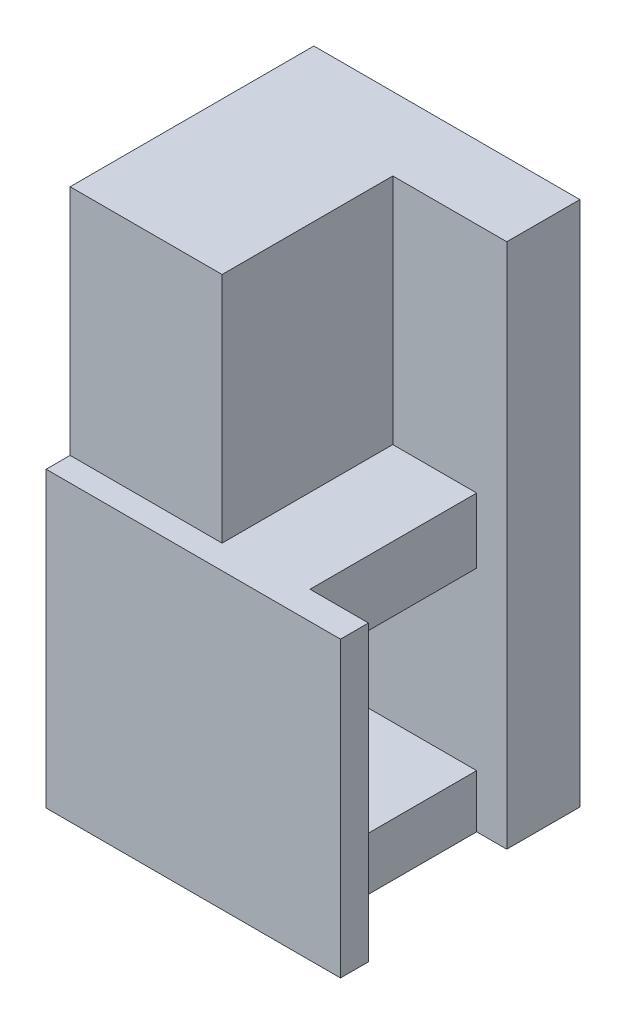
ISO-10303-21;
HEADER;
FILE_DESCRIPTION(('STEP AP214'),'2;1');
FILE_NAME('part.step','',(''),(''),'','','');
FILE_SCHEMA(('AUTOMOTIVE_DESIGN { 1 0 10303 214 1 1 1 1 }'));
ENDSEC;
DATA;
#1=APPLICATION_CONTEXT('core data for automotive mechanical design processes');
#2=APPLICATION_PROTOCOL_DEFINITION('international standard','automotive_design',2000,#1);
#3=PRODUCT_CONTEXT('',#1,'mechanical');
#4=PRODUCT('Part','Part','',(#3));
#5=PRODUCT_RELATED_PRODUCT_CATEGORY('part','',(#4));
#6=PRODUCT_DEFINITION_FORMATION('','',#4);
#7=PRODUCT_DEFINITION_CONTEXT('part definition',#1,'design');
#8=PRODUCT_DEFINITION('design','',#6,#7);
#9=PRODUCT_DEFINITION_SHAPE('','',#8);
#10=(LENGTH_UNIT() NAMED_UNIT(*) SI_UNIT(.MILLI.,.METRE.));
#11=(NAMED_UNIT(*) PLANE_ANGLE_UNIT() SI_UNIT($,.RADIAN.));
#12=(NAMED_UNIT(*) SI_UNIT($,.STERADIAN.) SOLID_ANGLE_UNIT());
#13=UNCERTAINTY_MEASURE_WITH_UNIT(LENGTH_MEASURE(1.E-05),#10,'distance_accuracy_value','');
#14=(GEOMETRIC_REPRESENTATION_CONTEXT(3) GLOBAL_UNCERTAINTY_ASSIGNED_CONTEXT((#13)) GLOBAL_UNIT_ASSIGNED_CONTEXT((#10,
#11,#12)) REPRESENTATION_CONTEXT('',''));
#15=CARTESIAN_POINT('',(0.,0.,0.));
#16=DIRECTION('',(0.,0.,1.));
#17=DIRECTION('',(1.,0.,0.));
#18=AXIS2_PLACEMENT_3D('',#15,#16,#17);
#19=CARTESIAN_POINT('',(502.75,344.704178151443,428.057475320664));
#20=DIRECTION('',(0.,0.,1.));
#21=DIRECTION('',(-1.,0.,0.));
#22=AXIS2_PLACEMENT_3D('',#19,#20,#21);
#23=PLANE('',#22);
#24=DIRECTION('',(0.,1.,0.));
#25=VECTOR('',#24,1.);
#26=CARTESIAN_POINT('',(525.5,299.704178151443,428.057475320664));
#27=LINE('',#26,#25);
#28=CARTESIAN_POINT('',(525.5,299.704178151443,428.057475320664));
#29=VERTEX_POINT('',#28);
#30=CARTESIAN_POINT('',(525.5,389.704178151443,428.057475320664));
#31=VERTEX_POINT('',#30);
#32=EDGE_CURVE('E11',#29,#31,#27,.T.);
#33=ORIENTED_EDGE('',*,*,#32,.F.);
#34=DIRECTION('',(1.,0.,0.));
#35=VECTOR('',#34,1.);
#36=CARTESIAN_POINT('',(480.,299.704178151443,428.057475320664));
#37=LINE('',#36,#35);
#38=CARTESIAN_POINT('',(480.,299.704178151443,428.057475320664));
#39=VERTEX_POINT('',#38);
#40=EDGE_CURVE('E24',#39,#29,#37,.T.);
#41=ORIENTED_EDGE('',*,*,#40,.F.);
#42=DIRECTION('',(0.,-1.,0.));
#43=VECTOR('',#42,1.);
#44=CARTESIAN_POINT('',(480.,389.704178151443,428.057475320664));
#45=LINE('',#44,#43);
#46=CARTESIAN_POINT('',(480.,389.704178151443,428.057475320664));
#47=VERTEX_POINT('',#46);
#48=EDGE_CURVE('E417',#47,#39,#45,.T.);
#49=ORIENTED_EDGE('',*,*,#48,.F.);
#50=DIRECTION('',(-1.,0.,0.));
#51=VECTOR('',#50,1.);
#52=CARTESIAN_POINT('',(525.5,389.704178151443,428.057475320664));
#53=LINE('',#52,#51);
#54=EDGE_CURVE('E412',#31,#47,#53,.T.);
#55=ORIENTED_EDGE('',*,*,#54,.F.);
#56=EDGE_LOOP('',(#33,#41,#49,#55));
#57=FACE_BOUND('',#56,.T.);
#58=ADVANCED_FACE('F16',(#57),#23,.F.);
#59=CARTESIAN_POINT('',(525.5,299.704178151443,428.057475320664));
#60=DIRECTION('',(1.,0.,0.));
#61=DIRECTION('',(0.,1.,0.));
#62=AXIS2_PLACEMENT_3D('',#59,#60,#61);
#63=PLANE('',#62);
#64=ORIENTED_EDGE('',*,*,#32,.T.);
#65=DIRECTION('',(0.,0.,1.));
#66=VECTOR('',#65,1.);
#67=CARTESIAN_POINT('',(525.5,389.704178151443,428.057475320664));
#68=LINE('',#67,#66);
#69=CARTESIAN_POINT('',(525.5,389.704178151443,440.557475320664));
#70=VERTEX_POINT('',#69);
#71=EDGE_CURVE('E408',#31,#70,#68,.T.);
#72=ORIENTED_EDGE('',*,*,#71,.T.);
#73=DIRECTION('',(0.,1.,0.));
#74=VECTOR('',#73,1.);
#75=CARTESIAN_POINT('',(525.5,299.704178151443,440.557475320664));
#76=LINE('',#75,#74);
#77=CARTESIAN_POINT('',(525.5,299.704178151443,440.557475320664));
#78=VERTEX_POINT('',#77);
#79=EDGE_CURVE('E403',#78,#70,#76,.T.);
#80=ORIENTED_EDGE('',*,*,#79,.F.);
#81=DIRECTION('',(0.,0.,1.));
#82=VECTOR('',#81,1.);
#83=CARTESIAN_POINT('',(525.5,299.704178151443,428.057475320664));
#84=LINE('',#83,#82);
#85=EDGE_CURVE('E398',#29,#78,#84,.T.);
#86=ORIENTED_EDGE('',*,*,#85,.F.);
#87=EDGE_LOOP('',(#64,#72,#80,#86));
#88=FACE_BOUND('',#87,.T.);
#89=ADVANCED_FACE('F435',(#88),#63,.T.);
#90=CARTESIAN_POINT('',(480.,389.704178151443,428.057475320664));
#91=DIRECTION('',(-1.,0.,0.));
#92=DIRECTION('',(0.,-1.,0.));
#93=AXIS2_PLACEMENT_3D('',#90,#91,#92);
#94=PLANE('',#93);
#95=DIRECTION('',(0.,-1.,0.));
#96=VECTOR('',#95,1.);
#97=CARTESIAN_POINT('',(480.,349.240469703761,460.057475320664));
#98=LINE('',#97,#96);
#99=CARTESIAN_POINT('',(480.,338.776761256078,460.057475320664));
#100=VERTEX_POINT('',#99);
#101=CARTESIAN_POINT('',(480.,308.776761256078,460.057475320664));
#102=VERTEX_POINT('',#101);
#103=EDGE_CURVE('E394',#100,#102,#98,.T.);
#104=ORIENTED_EDGE('',*,*,#103,.T.);
#105=DIRECTION('',(0.,0.,-1.));
#106=VECTOR('',#105,1.);
#107=CARTESIAN_POINT('',(480.,308.776761256079,434.307475320664));
#108=LINE('',#107,#106);
#109=CARTESIAN_POINT('',(480.,308.776761256078,440.557475320664));
#110=VERTEX_POINT('',#109);
#111=EDGE_CURVE('E390',#102,#110,#108,.T.);
#112=ORIENTED_EDGE('',*,*,#111,.T.);
#113=DIRECTION('',(0.,1.,0.));
#114=VECTOR('',#113,1.);
#115=CARTESIAN_POINT('',(480.,364.240469703761,440.557475320664));
#116=LINE('',#115,#114);
#117=CARTESIAN_POINT('',(480.,338.776761256078,440.557475320664));
#118=VERTEX_POINT('',#117);
#119=EDGE_CURVE('E386',#110,#118,#116,.T.);
#120=ORIENTED_EDGE('',*,*,#119,.T.);
#121=DIRECTION('',(0.,0.,1.));
#122=VECTOR('',#121,1.);
#123=CARTESIAN_POINT('',(480.,338.776761256078,444.057475320664));
#124=LINE('',#123,#122);
#125=EDGE_CURVE('E382',#118,#100,#124,.T.);
#126=ORIENTED_EDGE('',*,*,#125,.T.);
#127=EDGE_LOOP('',(#104,#112,#120,#126));
#128=FACE_BOUND('',#127,.T.);
#129=DIRECTION('',(0.,1.,0.));
#130=VECTOR('',#129,1.);
#131=CARTESIAN_POINT('',(480.,357.254178151443,473.857475320664));
#132=LINE('',#131,#130);
#133=CARTESIAN_POINT('',(480.,299.704178151443,473.857475320664));
#134=VERTEX_POINT('',#133);
#135=CARTESIAN_POINT('',(480.,349.904178151443,473.857475320664));
#136=VERTEX_POINT('',#135);
#137=EDGE_CURVE('E378',#134,#136,#132,.T.);
#138=ORIENTED_EDGE('',*,*,#137,.T.);
#139=DIRECTION('',(0.,0.,-1.));
#140=VECTOR('',#139,1.);
#141=CARTESIAN_POINT('',(480.,349.904178151443,455.407475320664));
#142=LINE('',#141,#140);
#143=CARTESIAN_POINT('',(480.,349.904178151443,469.757475320664));
#144=VERTEX_POINT('',#143);
#145=EDGE_CURVE('E167',#136,#144,#142,.T.);
#146=ORIENTED_EDGE('',*,*,#145,.T.);
#147=DIRECTION('',(0.,1.,0.));
#148=VECTOR('',#147,1.);
#149=CARTESIAN_POINT('',(480.,367.204178151443,469.757475320664));
#150=LINE('',#149,#148);
#151=CARTESIAN_POINT('',(480.,389.704178151443,469.757475320664));
#152=VERTEX_POINT('',#151);
#153=EDGE_CURVE('E371',#144,#152,#150,.T.);
#154=ORIENTED_EDGE('',*,*,#153,.T.);
#155=DIRECTION('',(0.,0.,1.));
#156=VECTOR('',#155,1.);
#157=CARTESIAN_POINT('',(480.,389.704178151443,428.057475320664));
#158=LINE('',#157,#156);
#159=EDGE_CURVE('E366',#47,#152,#158,.T.);
#160=ORIENTED_EDGE('',*,*,#159,.F.);
#161=ORIENTED_EDGE('',*,*,#48,.T.);
#162=DIRECTION('',(0.,0.,1.));
#163=VECTOR('',#162,1.);
#164=CARTESIAN_POINT('',(480.,299.704178151443,428.057475320664));
#165=LINE('',#164,#163);
#166=EDGE_CURVE('E362',#39,#134,#165,.T.);
#167=ORIENTED_EDGE('',*,*,#166,.T.);
#168=EDGE_LOOP('',(#138,#146,#154,#160,#161,#167));
#169=FACE_BOUND('',#168,.T.);
#170=ADVANCED_FACE('F430',(#128,#169),#94,.T.);
#171=CARTESIAN_POINT('',(502.75,344.704178151443,440.557475320664));
#172=DIRECTION('',(0.,0.,1.));
#173=DIRECTION('',(0.,1.,0.));
#174=AXIS2_PLACEMENT_3D('',#171,#172,#173);
#175=PLANE('',#174);
#176=DIRECTION('',(0.,-1.,0.));
#177=VECTOR('',#176,1.);
#178=CARTESIAN_POINT('',(520.35,347.304178151443,440.557475320664));
#179=LINE('',#178,#177);
#180=CARTESIAN_POINT('',(520.35,349.904178151443,440.557475320664));
#181=VERTEX_POINT('',#180);
#182=CARTESIAN_POINT('',(520.35,338.776761256078,440.557475320664));
#183=VERTEX_POINT('',#182);
#184=EDGE_CURVE('E358',#181,#183,#179,.T.);
#185=ORIENTED_EDGE('',*,*,#184,.T.);
#186=DIRECTION('',(-1.,0.,0.));
#187=VECTOR('',#186,1.);
#188=CARTESIAN_POINT('',(520.35,338.776761256078,440.557475320664));
#189=LINE('',#188,#187);
#190=EDGE_CURVE('E353',#183,#118,#189,.T.);
#191=ORIENTED_EDGE('',*,*,#190,.T.);
#192=ORIENTED_EDGE('',*,*,#119,.F.);
#193=DIRECTION('',(-1.,0.,0.));
#194=VECTOR('',#193,1.);
#195=CARTESIAN_POINT('',(520.35,308.776761256078,440.557475320664));
#196=LINE('',#195,#194);
#197=CARTESIAN_POINT('',(520.35,308.776761256078,440.557475320664));
#198=VERTEX_POINT('',#197);
#199=EDGE_CURVE('E348',#198,#110,#196,.T.);
#200=ORIENTED_EDGE('',*,*,#199,.F.);
#201=DIRECTION('',(0.,-1.,0.));
#202=VECTOR('',#201,1.);
#203=CARTESIAN_POINT('',(520.35,347.304178151443,440.557475320664));
#204=LINE('',#203,#202);
#205=CARTESIAN_POINT('',(520.35,299.704178151443,440.557475320664));
#206=VERTEX_POINT('',#205);
#207=EDGE_CURVE('E344',#198,#206,#204,.T.);
#208=ORIENTED_EDGE('',*,*,#207,.T.);
#209=DIRECTION('',(1.,0.,0.));
#210=VECTOR('',#209,1.);
#211=CARTESIAN_POINT('',(480.,299.704178151443,440.557475320664));
#212=LINE('',#211,#210);
#213=EDGE_CURVE('E339',#206,#78,#212,.T.);
#214=ORIENTED_EDGE('',*,*,#213,.T.);
#215=ORIENTED_EDGE('',*,*,#79,.T.);
#216=DIRECTION('',(-1.,0.,0.));
#217=VECTOR('',#216,1.);
#218=CARTESIAN_POINT('',(525.5,389.704178151443,440.557475320664));
#219=LINE('',#218,#217);
#220=CARTESIAN_POINT('',(506.,389.704178151443,440.557475320664));
#221=VERTEX_POINT('',#220);
#222=EDGE_CURVE('E335',#70,#221,#219,.T.);
#223=ORIENTED_EDGE('',*,*,#222,.T.);
#224=DIRECTION('',(0.,-1.,0.));
#225=VECTOR('',#224,1.);
#226=CARTESIAN_POINT('',(506.,322.204178151443,440.557475320664));
#227=LINE('',#226,#225);
#228=CARTESIAN_POINT('',(506.,349.904178151443,440.557475320664));
#229=VERTEX_POINT('',#228);
#230=EDGE_CURVE('E331',#221,#229,#227,.T.);
#231=ORIENTED_EDGE('',*,*,#230,.T.);
#232=DIRECTION('',(1.,0.,0.));
#233=VECTOR('',#232,1.);
#234=CARTESIAN_POINT('',(504.375,349.904178151443,440.557475320664));
#235=LINE('',#234,#233);
#236=EDGE_CURVE('E327',#229,#181,#235,.T.);
#237=ORIENTED_EDGE('',*,*,#236,.T.);
#238=EDGE_LOOP('',(#185,#191,#192,#200,#208,#214,#215,#223,#231,#237));
#239=FACE_BOUND('',#238,.T.);
#240=ADVANCED_FACE('F441',(#239),#175,.T.);
#241=CARTESIAN_POINT('',(506.,299.704178151443,440.557475320664));
#242=DIRECTION('',(1.,0.,0.));
#243=DIRECTION('',(0.,1.,0.));
#244=AXIS2_PLACEMENT_3D('',#241,#242,#243);
#245=PLANE('',#244);
#246=DIRECTION('',(0.,-1.,0.));
#247=VECTOR('',#246,1.);
#248=CARTESIAN_POINT('',(506.,322.204178151443,469.757475320664));
#249=LINE('',#248,#247);
#250=CARTESIAN_POINT('',(506.,389.704178151443,469.757475320664));
#251=VERTEX_POINT('',#250);
#252=CARTESIAN_POINT('',(506.,349.904178151443,469.757475320664));
#253=VERTEX_POINT('',#252);
#254=EDGE_CURVE('E323',#251,#253,#249,.T.);
#255=ORIENTED_EDGE('',*,*,#254,.T.);
#256=DIRECTION('',(0.,0.,-1.));
#257=VECTOR('',#256,1.);
#258=CARTESIAN_POINT('',(506.,349.904178151443,461.657475320664));
#259=LINE('',#258,#257);
#260=EDGE_CURVE('E318',#253,#229,#259,.T.);
#261=ORIENTED_EDGE('',*,*,#260,.T.);
#262=ORIENTED_EDGE('',*,*,#230,.F.);
#263=DIRECTION('',(0.,0.,1.));
#264=VECTOR('',#263,1.);
#265=CARTESIAN_POINT('',(506.,389.704178151443,440.557475320664));
#266=LINE('',#265,#264);
#267=EDGE_CURVE('E314',#221,#251,#266,.T.);
#268=ORIENTED_EDGE('',*,*,#267,.T.);
#269=EDGE_LOOP('',(#255,#261,#262,#268));
#270=FACE_BOUND('',#269,.T.);
#271=ADVANCED_FACE('F443',(#270),#245,.T.);
#272=CARTESIAN_POINT('',(480.,299.704178151443,428.057475320664));
#273=DIRECTION('',(0.,-1.,0.));
#274=DIRECTION('',(1.,0.,0.));
#275=AXIS2_PLACEMENT_3D('',#272,#273,#274);
#276=PLANE('',#275);
#277=DIRECTION('',(-1.,0.,0.));
#278=VECTOR('',#277,1.);
#279=CARTESIAN_POINT('',(490.0875,299.704178151443,473.857475320664));
#280=LINE('',#279,#278);
#281=CARTESIAN_POINT('',(530.35,299.704178151443,473.857475320664));
#282=VERTEX_POINT('',#281);
#283=EDGE_CURVE('E173',#282,#134,#280,.T.);
#284=ORIENTED_EDGE('',*,*,#283,.T.);
#285=ORIENTED_EDGE('',*,*,#166,.F.);
#286=ORIENTED_EDGE('',*,*,#40,.T.);
#287=ORIENTED_EDGE('',*,*,#85,.T.);
#288=ORIENTED_EDGE('',*,*,#213,.F.);
#289=DIRECTION('',(0.,0.,1.));
#290=VECTOR('',#289,1.);
#291=CARTESIAN_POINT('',(520.35,299.704178151443,482.757475320664));
#292=LINE('',#291,#290);
#293=CARTESIAN_POINT('',(520.35,299.704178151443,469.068178567133));
#294=VERTEX_POINT('',#293);
#295=EDGE_CURVE('E307',#206,#294,#292,.T.);
#296=ORIENTED_EDGE('',*,*,#295,.T.);
#297=DIRECTION('',(-1.,0.,0.));
#298=VECTOR('',#297,1.);
#299=CARTESIAN_POINT('',(520.35,299.704178151443,469.068178567133));
#300=LINE('',#299,#298);
#301=CARTESIAN_POINT('',(530.35,299.704178151443,469.068178567133));
#302=VERTEX_POINT('',#301);
#303=EDGE_CURVE('E302',#302,#294,#300,.T.);
#304=ORIENTED_EDGE('',*,*,#303,.F.);
#305=DIRECTION('',(0.,0.,-1.));
#306=VECTOR('',#305,1.);
#307=CARTESIAN_POINT('',(530.35,299.704178151443,486.857475320664));
#308=LINE('',#307,#306);
#309=EDGE_CURVE('E298',#282,#302,#308,.T.);
#310=ORIENTED_EDGE('',*,*,#309,.F.);
#311=EDGE_LOOP('',(#284,#285,#286,#287,#288,#296,#304,#310));
#312=FACE_BOUND('',#311,.T.);
#313=ADVANCED_FACE('F427',(#312),#276,.T.);
#314=CARTESIAN_POINT('',(520.35,308.776761256078,440.557475320664));
#315=DIRECTION('',(0.,-1.,0.));
#316=DIRECTION('',(0.,0.,1.));
#317=AXIS2_PLACEMENT_3D('',#314,#315,#316);
#318=PLANE('',#317);
#319=ORIENTED_EDGE('',*,*,#111,.F.);
#320=DIRECTION('',(-1.,0.,0.));
#321=VECTOR('',#320,1.);
#322=CARTESIAN_POINT('',(520.35,308.776761256078,460.057475320664));
#323=LINE('',#322,#321);
#324=CARTESIAN_POINT('',(520.35,308.776761256078,460.057475320664));
#325=VERTEX_POINT('',#324);
#326=EDGE_CURVE('E293',#325,#102,#323,.T.);
#327=ORIENTED_EDGE('',*,*,#326,.F.);
#328=DIRECTION('',(0.,0.,1.));
#329=VECTOR('',#328,1.);
#330=CARTESIAN_POINT('',(520.35,308.776761256078,461.657475320664));
#331=LINE('',#330,#329);
#332=EDGE_CURVE('E288',#198,#325,#331,.T.);
#333=ORIENTED_EDGE('',*,*,#332,.F.);
#334=ORIENTED_EDGE('',*,*,#199,.T.);
#335=EDGE_LOOP('',(#319,#327,#333,#334));
#336=FACE_BOUND('',#335,.T.);
#337=ADVANCED_FACE('F465',(#336),#318,.F.);
#338=CARTESIAN_POINT('',(520.35,308.776761256078,460.057475320664));
#339=DIRECTION('',(0.,0.,1.));
#340=DIRECTION('',(0.,1.,0.));
#341=AXIS2_PLACEMENT_3D('',#338,#339,#340);
#342=PLANE('',#341);
#343=DIRECTION('',(1.,0.,0.));
#344=VECTOR('',#343,1.);
#345=CARTESIAN_POINT('',(520.35,309.,460.057475320664));
#346=LINE('',#345,#344);
#347=CARTESIAN_POINT('',(505.35,309.,460.057475320664));
#348=VERTEX_POINT('',#347);
#349=CARTESIAN_POINT('',(520.35,309.,460.057475320664));
#350=VERTEX_POINT('',#349);
#351=EDGE_CURVE('E284',#348,#350,#346,.T.);
#352=ORIENTED_EDGE('',*,*,#351,.T.);
#353=DIRECTION('',(0.,1.,0.));
#354=VECTOR('',#353,1.);
#355=CARTESIAN_POINT('',(520.35,329.340469703761,460.057475320664));
#356=LINE('',#355,#354);
#357=EDGE_CURVE('E279',#325,#350,#356,.T.);
#358=ORIENTED_EDGE('',*,*,#357,.F.);
#359=ORIENTED_EDGE('',*,*,#326,.T.);
#360=ORIENTED_EDGE('',*,*,#103,.F.);
#361=DIRECTION('',(-1.,0.,0.));
#362=VECTOR('',#361,1.);
#363=CARTESIAN_POINT('',(520.35,338.776761256078,460.057475320664));
#364=LINE('',#363,#362);
#365=CARTESIAN_POINT('',(505.35,338.776761256078,460.057475320664));
#366=VERTEX_POINT('',#365);
#367=EDGE_CURVE('E274',#366,#100,#364,.T.);
#368=ORIENTED_EDGE('',*,*,#367,.F.);
#369=DIRECTION('',(0.,-1.,0.));
#370=VECTOR('',#369,1.);
#371=CARTESIAN_POINT('',(505.35,309.388380628039,460.057475320664));
#372=LINE('',#371,#370);
#373=EDGE_CURVE('E270',#366,#348,#372,.T.);
#374=ORIENTED_EDGE('',*,*,#373,.T.);
#375=EDGE_LOOP('',(#352,#358,#359,#360,#368,#374));
#376=FACE_BOUND('',#375,.T.);
#377=ADVANCED_FACE('F500',(#376),#342,.F.);
#378=CARTESIAN_POINT('',(520.35,338.776761256078,460.057475320664));
#379=DIRECTION('',(0.,1.,0.));
#380=DIRECTION('',(0.,0.,-1.));
#381=AXIS2_PLACEMENT_3D('',#378,#379,#380);
#382=PLANE('',#381);
#383=DIRECTION('',(-1.,0.,0.));
#384=VECTOR('',#383,1.);
#385=CARTESIAN_POINT('',(520.35,338.776761256078,460.));
#386=LINE('',#385,#384);
#387=CARTESIAN_POINT('',(520.35,338.776761256078,460.));
#388=VERTEX_POINT('',#387);
#389=CARTESIAN_POINT('',(505.35,338.776761256078,460.));
#390=VERTEX_POINT('',#389);
#391=EDGE_CURVE('E266',#388,#390,#386,.T.);
#392=ORIENTED_EDGE('',*,*,#391,.T.);
#393=DIRECTION('',(0.,0.,1.));
#394=VECTOR('',#393,1.);
#395=CARTESIAN_POINT('',(505.35,338.776761256078,462.528737660332));
#396=LINE('',#395,#394);
#397=EDGE_CURVE('E261',#390,#366,#396,.T.);
#398=ORIENTED_EDGE('',*,*,#397,.T.);
#399=ORIENTED_EDGE('',*,*,#367,.T.);
#400=ORIENTED_EDGE('',*,*,#125,.F.);
#401=ORIENTED_EDGE('',*,*,#190,.F.);
#402=DIRECTION('',(0.,0.,-1.));
#403=VECTOR('',#402,1.);
#404=CARTESIAN_POINT('',(520.35,338.776761256078,471.407475320664));
#405=LINE('',#404,#403);
#406=EDGE_CURVE('E256',#388,#183,#405,.T.);
#407=ORIENTED_EDGE('',*,*,#406,.F.);
#408=EDGE_LOOP('',(#392,#398,#399,#400,#401,#407));
#409=FACE_BOUND('',#408,.T.);
#410=ADVANCED_FACE('F457',(#409),#382,.F.);
#411=CARTESIAN_POINT('',(520.35,349.904178151443,482.757475320664));
#412=DIRECTION('',(1.,0.,0.));
#413=DIRECTION('',(0.,-1.,0.));
#414=AXIS2_PLACEMENT_3D('',#411,#412,#413);
#415=PLANE('',#414);
#416=DIRECTION('',(0.,-1.,0.));
#417=VECTOR('',#416,1.);
#418=CARTESIAN_POINT('',(520.35,324.804178151443,469.068178567133));
#419=LINE('',#418,#417);
#420=CARTESIAN_POINT('',(520.35,349.904178151443,469.068178567133));
#421=VERTEX_POINT('',#420);
#422=EDGE_CURVE('E251',#421,#294,#419,.T.);
#423=ORIENTED_EDGE('',*,*,#422,.T.);
#424=ORIENTED_EDGE('',*,*,#295,.F.);
#425=ORIENTED_EDGE('',*,*,#207,.F.);
#426=ORIENTED_EDGE('',*,*,#332,.T.);
#427=ORIENTED_EDGE('',*,*,#357,.T.);
#428=DIRECTION('',(0.,0.,1.));
#429=VECTOR('',#428,1.);
#430=CARTESIAN_POINT('',(520.35,309.,476.378737660332));
#431=LINE('',#430,#429);
#432=CARTESIAN_POINT('',(520.35,309.,468.5));
#433=VERTEX_POINT('',#432);
#434=EDGE_CURVE('E247',#350,#433,#431,.T.);
#435=ORIENTED_EDGE('',*,*,#434,.T.);
#436=DIRECTION('',(0.,-1.,0.));
#437=VECTOR('',#436,1.);
#438=CARTESIAN_POINT('',(520.35,329.952089075722,468.5));
#439=LINE('',#438,#437);
#440=CARTESIAN_POINT('',(520.35,339.,468.5));
#441=VERTEX_POINT('',#440);
#442=EDGE_CURVE('E242',#441,#433,#439,.T.);
#443=ORIENTED_EDGE('',*,*,#442,.F.);
#444=DIRECTION('',(0.,0.,1.));
#445=VECTOR('',#444,1.);
#446=CARTESIAN_POINT('',(520.35,339.,476.378737660332));
#447=LINE('',#446,#445);
#448=CARTESIAN_POINT('',(520.35,339.,460.));
#449=VERTEX_POINT('',#448);
#450=EDGE_CURVE('E237',#449,#441,#447,.T.);
#451=ORIENTED_EDGE('',*,*,#450,.F.);
#452=DIRECTION('',(0.,-1.,0.));
#453=VECTOR('',#452,1.);
#454=CARTESIAN_POINT('',(520.35,344.952089075722,460.));
#455=LINE('',#454,#453);
#456=EDGE_CURVE('E232',#449,#388,#455,.T.);
#457=ORIENTED_EDGE('',*,*,#456,.T.);
#458=ORIENTED_EDGE('',*,*,#406,.T.);
#459=ORIENTED_EDGE('',*,*,#184,.F.);
#460=DIRECTION('',(0.,0.,1.));
#461=VECTOR('',#460,1.);
#462=CARTESIAN_POINT('',(520.35,349.904178151443,482.757475320664));
#463=LINE('',#462,#461);
#464=EDGE_CURVE('E228',#181,#421,#463,.T.);
#465=ORIENTED_EDGE('',*,*,#464,.T.);
#466=EDGE_LOOP('',(#423,#424,#425,#426,#427,#435,#443,#451,#457,#458,#459,#465));
#467=FACE_BOUND('',#466,.T.);
#468=ADVANCED_FACE('F452',(#467),#415,.T.);
#469=CARTESIAN_POINT('',(520.35,309.,460.));
#470=DIRECTION('',(0.,-1.,0.));
#471=DIRECTION('',(0.,0.,-1.));
#472=AXIS2_PLACEMENT_3D('',#469,#470,#471);
#473=PLANE('',#472);
#474=DIRECTION('',(1.,0.,0.));
#475=VECTOR('',#474,1.);
#476=CARTESIAN_POINT('',(520.35,309.,468.5));
#477=LINE('',#476,#475);
#478=CARTESIAN_POINT('',(505.35,309.,468.5));
#479=VERTEX_POINT('',#478);
#480=EDGE_CURVE('E223',#479,#433,#477,.T.);
#481=ORIENTED_EDGE('',*,*,#480,.T.);
#482=ORIENTED_EDGE('',*,*,#434,.F.);
#483=ORIENTED_EDGE('',*,*,#351,.F.);
#484=DIRECTION('',(0.,0.,-1.));
#485=VECTOR('',#484,1.);
#486=CARTESIAN_POINT('',(505.35,309.,470.));
#487=LINE('',#486,#485);
#488=EDGE_CURVE('E218',#479,#348,#487,.T.);
#489=ORIENTED_EDGE('',*,*,#488,.F.);
#490=EDGE_LOOP('',(#481,#482,#483,#489));
#491=FACE_BOUND('',#490,.T.);
#492=ADVANCED_FACE('F508',(#491),#473,.F.);
#493=CARTESIAN_POINT('',(505.35,325.,465.));
#494=DIRECTION('',(-1.,0.,0.));
#495=DIRECTION('',(0.,0.,1.));
#496=AXIS2_PLACEMENT_3D('',#493,#494,#495);
#497=PLANE('',#496);
#498=DIRECTION('',(0.,-1.,0.));
#499=VECTOR('',#498,1.);
#500=CARTESIAN_POINT('',(505.35,317.5,468.5));
#501=LINE('',#500,#499);
#502=CARTESIAN_POINT('',(505.35,339.,468.5));
#503=VERTEX_POINT('',#502);
#504=EDGE_CURVE('E213',#503,#479,#501,.T.);
#505=ORIENTED_EDGE('',*,*,#504,.T.);
#506=ORIENTED_EDGE('',*,*,#488,.T.);
#507=ORIENTED_EDGE('',*,*,#373,.F.);
#508=ORIENTED_EDGE('',*,*,#397,.F.);
#509=DIRECTION('',(0.,-1.,0.));
#510=VECTOR('',#509,1.);
#511=CARTESIAN_POINT('',(505.35,310.,460.));
#512=LINE('',#511,#510);
#513=CARTESIAN_POINT('',(505.35,339.,460.));
#514=VERTEX_POINT('',#513);
#515=EDGE_CURVE('E208',#514,#390,#512,.T.);
#516=ORIENTED_EDGE('',*,*,#515,.F.);
#517=DIRECTION('',(0.,0.,1.));
#518=VECTOR('',#517,1.);
#519=CARTESIAN_POINT('',(505.35,339.,467.5));
#520=LINE('',#519,#518);
#521=EDGE_CURVE('E204',#514,#503,#520,.T.);
#522=ORIENTED_EDGE('',*,*,#521,.T.);
#523=EDGE_LOOP('',(#505,#506,#507,#508,#516,#522));
#524=FACE_BOUND('',#523,.T.);
#525=ADVANCED_FACE('F511',(#524),#497,.F.);
#526=CARTESIAN_POINT('',(520.35,340.,460.));
#527=DIRECTION('',(0.,0.,-1.));
#528=DIRECTION('',(0.,-1.,0.));
#529=AXIS2_PLACEMENT_3D('',#526,#527,#528);
#530=PLANE('',#529);
#531=DIRECTION('',(-1.,0.,0.));
#532=VECTOR('',#531,1.);
#533=CARTESIAN_POINT('',(520.35,339.,460.));
#534=LINE('',#533,#532);
#535=EDGE_CURVE('E199',#449,#514,#534,.T.);
#536=ORIENTED_EDGE('',*,*,#535,.T.);
#537=ORIENTED_EDGE('',*,*,#515,.T.);
#538=ORIENTED_EDGE('',*,*,#391,.F.);
#539=ORIENTED_EDGE('',*,*,#456,.F.);
#540=EDGE_LOOP('',(#536,#537,#538,#539));
#541=FACE_BOUND('',#540,.T.);
#542=ADVANCED_FACE('F515',(#541),#530,.F.);
#543=CARTESIAN_POINT('',(525.5,389.704178151443,428.057475320664));
#544=DIRECTION('',(0.,1.,0.));
#545=DIRECTION('',(-1.,0.,0.));
#546=AXIS2_PLACEMENT_3D('',#543,#544,#545);
#547=PLANE('',#546);
#548=DIRECTION('',(1.,0.,0.));
#549=VECTOR('',#548,1.);
#550=CARTESIAN_POINT('',(509.25,389.704178151443,469.757475320664));
#551=LINE('',#550,#549);
#552=EDGE_CURVE('E194',#152,#251,#551,.T.);
#553=ORIENTED_EDGE('',*,*,#552,.T.);
#554=ORIENTED_EDGE('',*,*,#267,.F.);
#555=ORIENTED_EDGE('',*,*,#222,.F.);
#556=ORIENTED_EDGE('',*,*,#71,.F.);
#557=ORIENTED_EDGE('',*,*,#54,.T.);
#558=ORIENTED_EDGE('',*,*,#159,.T.);
#559=EDGE_LOOP('',(#553,#554,#555,#556,#557,#558));
#560=FACE_BOUND('',#559,.T.);
#561=ADVANCED_FACE('F437',(#560),#547,.T.);
#562=CARTESIAN_POINT('',(493.,344.704178151443,469.757475320664));
#563=DIRECTION('',(0.,0.,-1.));
#564=DIRECTION('',(-1.,0.,0.));
#565=AXIS2_PLACEMENT_3D('',#562,#563,#564);
#566=PLANE('',#565);
#567=DIRECTION('',(-1.,0.,0.));
#568=VECTOR('',#567,1.);
#569=CARTESIAN_POINT('',(506.675,349.904178151443,469.757475320664));
#570=LINE('',#569,#568);
#571=EDGE_CURVE('E190',#253,#144,#570,.T.);
#572=ORIENTED_EDGE('',*,*,#571,.F.);
#573=ORIENTED_EDGE('',*,*,#254,.F.);
#574=ORIENTED_EDGE('',*,*,#552,.F.);
#575=ORIENTED_EDGE('',*,*,#153,.F.);
#576=EDGE_LOOP('',(#572,#573,#574,#575));
#577=FACE_BOUND('',#576,.T.);
#578=ADVANCED_FACE('F522',(#577),#566,.F.);
#579=CARTESIAN_POINT('',(520.35,339.,470.));
#580=DIRECTION('',(0.,-1.,0.));
#581=DIRECTION('',(0.,0.,-1.));
#582=AXIS2_PLACEMENT_3D('',#579,#580,#581);
#583=PLANE('',#582);
#584=DIRECTION('',(-1.,0.,0.));
#585=VECTOR('',#584,1.);
#586=CARTESIAN_POINT('',(520.35,339.,468.5));
#587=LINE('',#586,#585);
#588=EDGE_CURVE('E185',#441,#503,#587,.T.);
#589=ORIENTED_EDGE('',*,*,#588,.T.);
#590=ORIENTED_EDGE('',*,*,#521,.F.);
#591=ORIENTED_EDGE('',*,*,#535,.F.);
#592=ORIENTED_EDGE('',*,*,#450,.T.);
#593=EDGE_LOOP('',(#589,#590,#591,#592));
#594=FACE_BOUND('',#593,.T.);
#595=ADVANCED_FACE('F480',(#594),#583,.T.);
#596=CARTESIAN_POINT('',(520.35,310.,468.5));
#597=DIRECTION('',(0.,0.,-1.));
#598=DIRECTION('',(-1.,0.,0.));
#599=AXIS2_PLACEMENT_3D('',#596,#597,#598);
#600=PLANE('',#599);
#601=ORIENTED_EDGE('',*,*,#588,.F.);
#602=ORIENTED_EDGE('',*,*,#442,.T.);
#603=ORIENTED_EDGE('',*,*,#480,.F.);
#604=ORIENTED_EDGE('',*,*,#504,.F.);
#605=EDGE_LOOP('',(#601,#602,#603,#604));
#606=FACE_BOUND('',#605,.T.);
#607=ADVANCED_FACE('F472',(#606),#600,.T.);
#608=CARTESIAN_POINT('',(520.35,299.704178151443,469.068178567133));
#609=DIRECTION('',(0.,0.,-1.));
#610=DIRECTION('',(-1.,0.,0.));
#611=AXIS2_PLACEMENT_3D('',#608,#609,#610);
#612=PLANE('',#611);
#613=ORIENTED_EDGE('',*,*,#422,.F.);
#614=DIRECTION('',(1.,0.,0.));
#615=VECTOR('',#614,1.);
#616=CARTESIAN_POINT('',(520.35,349.904178151443,469.068178567133));
#617=LINE('',#616,#615);
#618=CARTESIAN_POINT('',(530.35,349.904178151443,469.068178567133));
#619=VERTEX_POINT('',#618);
#620=EDGE_CURVE('E175',#421,#619,#617,.T.);
#621=ORIENTED_EDGE('',*,*,#620,.T.);
#622=DIRECTION('',(0.,-1.,0.));
#623=VECTOR('',#622,1.);
#624=CARTESIAN_POINT('',(530.35,349.904178151443,469.068178567133));
#625=LINE('',#624,#623);
#626=EDGE_CURVE('E158',#619,#302,#625,.T.);
#627=ORIENTED_EDGE('',*,*,#626,.T.);
#628=ORIENTED_EDGE('',*,*,#303,.T.);
#629=EDGE_LOOP('',(#613,#621,#627,#628));
#630=FACE_BOUND('',#629,.T.);
#631=ADVANCED_FACE('F470',(#630),#612,.T.);
#632=CARTESIAN_POINT('',(530.35,324.804178151443,484.962826943899));
#633=DIRECTION('',(1.,0.,0.));
#634=DIRECTION('',(0.,0.,-1.));
#635=AXIS2_PLACEMENT_3D('',#632,#633,#634);
#636=PLANE('',#635);
#637=DIRECTION('',(0.,-1.,0.));
#638=VECTOR('',#637,1.);
#639=CARTESIAN_POINT('',(530.35,324.804178151443,473.857475320664));
#640=LINE('',#639,#638);
#641=CARTESIAN_POINT('',(530.35,349.904178151443,473.857475320664));
#642=VERTEX_POINT('',#641);
#643=EDGE_CURVE('E155',#642,#282,#640,.T.);
#644=ORIENTED_EDGE('',*,*,#643,.T.);
#645=ORIENTED_EDGE('',*,*,#309,.T.);
#646=ORIENTED_EDGE('',*,*,#626,.F.);
#647=DIRECTION('',(0.,0.,-1.));
#648=VECTOR('',#647,1.);
#649=CARTESIAN_POINT('',(530.35,349.904178151443,483.068178567133));
#650=LINE('',#649,#648);
#651=EDGE_CURVE('E150',#642,#619,#650,.T.);
#652=ORIENTED_EDGE('',*,*,#651,.F.);
#653=EDGE_LOOP('',(#644,#645,#646,#652));
#654=FACE_BOUND('',#653,.T.);
#655=ADVANCED_FACE('F152',(#654),#636,.T.);
#656=CARTESIAN_POINT('',(506.,349.904178151443,482.757475320664));
#657=DIRECTION('',(0.,1.,0.));
#658=DIRECTION('',(1.,0.,0.));
#659=AXIS2_PLACEMENT_3D('',#656,#657,#658);
#660=PLANE('',#659);
#661=DIRECTION('',(1.,0.,0.));
#662=VECTOR('',#661,1.);
#663=CARTESIAN_POINT('',(503.0875,349.904178151443,473.857475320664));
#664=LINE('',#663,#662);
#665=EDGE_CURVE('E161',#136,#642,#664,.T.);
#666=ORIENTED_EDGE('',*,*,#665,.T.);
#667=ORIENTED_EDGE('',*,*,#651,.T.);
#668=ORIENTED_EDGE('',*,*,#620,.F.);
#669=ORIENTED_EDGE('',*,*,#464,.F.);
#670=ORIENTED_EDGE('',*,*,#236,.F.);
#671=ORIENTED_EDGE('',*,*,#260,.F.);
#672=ORIENTED_EDGE('',*,*,#571,.T.);
#673=ORIENTED_EDGE('',*,*,#145,.F.);
#674=EDGE_LOOP('',(#666,#667,#668,#669,#670,#671,#672,#673));
#675=FACE_BOUND('',#674,.T.);
#676=ADVANCED_FACE('F165',(#675),#660,.T.);
#677=CARTESIAN_POINT('',(500.175,324.804178151443,473.857475320664));
#678=DIRECTION('',(0.,0.,-1.));
#679=DIRECTION('',(-1.,0.,0.));
#680=AXIS2_PLACEMENT_3D('',#677,#678,#679);
#681=PLANE('',#680);
#682=ORIENTED_EDGE('',*,*,#665,.F.);
#683=ORIENTED_EDGE('',*,*,#137,.F.);
#684=ORIENTED_EDGE('',*,*,#283,.F.);
#685=ORIENTED_EDGE('',*,*,#643,.F.);
#686=EDGE_LOOP('',(#682,#683,#684,#685));
#687=FACE_BOUND('',#686,.T.);
#688=ADVANCED_FACE('F171',(#687),#681,.F.);
#689=CLOSED_SHELL('',(#58,#89,#170,#240,#271,#313,#337,#377,#410,#468,#492,#525,#542,#561,#578,
#595,#607,#631,#655,#676,#688));
#690=MANIFOLD_SOLID_BREP('B1',#689);
#691=ADVANCED_BREP_SHAPE_REPRESENTATION('',(#18,#690),#14);
#692=SHAPE_DEFINITION_REPRESENTATION(#9,#691);
ENDSEC;
END-ISO-10303-21;
